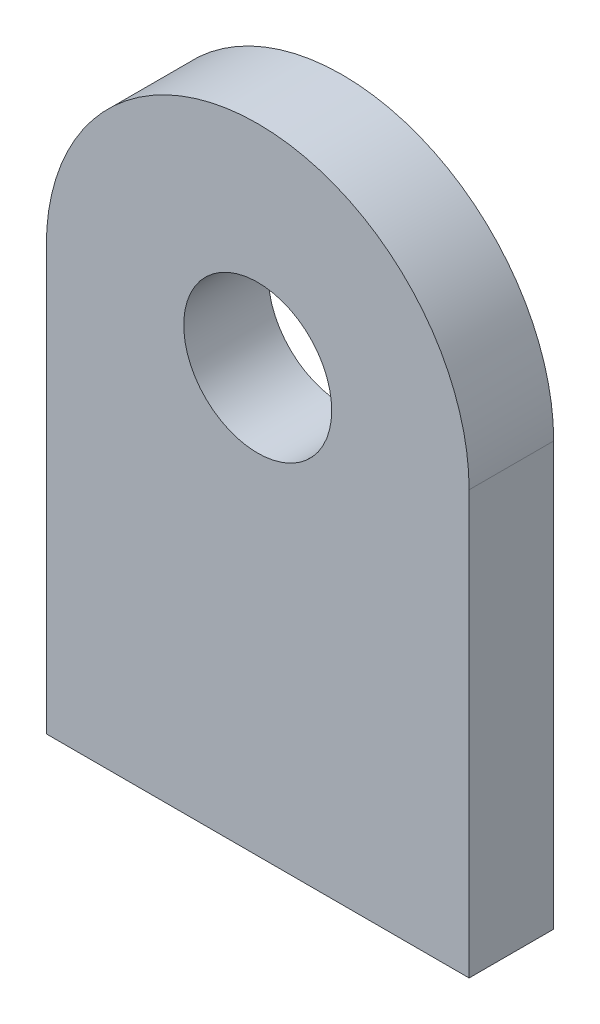
ISO-10303-21;
HEADER;
FILE_DESCRIPTION(('STEP AP214'),'2;1');
FILE_NAME('part.step','',(''),(''),'','','');
FILE_SCHEMA(('AUTOMOTIVE_DESIGN { 1 0 10303 214 1 1 1 1 }'));
ENDSEC;
DATA;
#1=APPLICATION_CONTEXT('core data for automotive mechanical design processes');
#2=APPLICATION_PROTOCOL_DEFINITION('international standard','automotive_design',2000,#1);
#3=PRODUCT_CONTEXT('',#1,'mechanical');
#4=PRODUCT('Part','Part','',(#3));
#5=PRODUCT_RELATED_PRODUCT_CATEGORY('part','',(#4));
#6=PRODUCT_DEFINITION_FORMATION('','',#4);
#7=PRODUCT_DEFINITION_CONTEXT('part definition',#1,'design');
#8=PRODUCT_DEFINITION('design','',#6,#7);
#9=PRODUCT_DEFINITION_SHAPE('','',#8);
#10=(LENGTH_UNIT() NAMED_UNIT(*) SI_UNIT(.MILLI.,.METRE.));
#11=(NAMED_UNIT(*) PLANE_ANGLE_UNIT() SI_UNIT($,.RADIAN.));
#12=(NAMED_UNIT(*) SI_UNIT($,.STERADIAN.) SOLID_ANGLE_UNIT());
#13=UNCERTAINTY_MEASURE_WITH_UNIT(LENGTH_MEASURE(1.E-05),#10,'distance_accuracy_value','');
#14=(GEOMETRIC_REPRESENTATION_CONTEXT(3) GLOBAL_UNCERTAINTY_ASSIGNED_CONTEXT((#13)) GLOBAL_UNIT_ASSIGNED_CONTEXT((#10,
#11,#12)) REPRESENTATION_CONTEXT('',''));
#15=CARTESIAN_POINT('',(0.,0.,0.));
#16=DIRECTION('',(0.,0.,1.));
#17=DIRECTION('',(1.,0.,0.));
#18=AXIS2_PLACEMENT_3D('',#15,#16,#17);
#19=CARTESIAN_POINT('',(0.,100.,20.));
#20=DIRECTION('',(0.,0.,1.));
#21=DIRECTION('',(1.,0.,0.));
#22=AXIS2_PLACEMENT_3D('',#19,#20,#21);
#23=PLANE('',#22);
#24=CARTESIAN_POINT('',(0.,100.,20.));
#25=DIRECTION('',(0.,0.,1.));
#26=DIRECTION('',(1.,0.,0.));
#27=AXIS2_PLACEMENT_3D('',#24,#25,#26);
#28=CIRCLE('',#27,50.);
#29=CARTESIAN_POINT('',(50.,100.,20.));
#30=VERTEX_POINT('',#29);
#31=CARTESIAN_POINT('',(-50.,100.,20.));
#32=VERTEX_POINT('',#31);
#33=EDGE_CURVE('E87',#30,#32,#28,.T.);
#34=ORIENTED_EDGE('',*,*,#33,.T.);
#35=DIRECTION('',(0.,-1.,0.));
#36=VECTOR('',#35,1.);
#37=CARTESIAN_POINT('',(-50.,100.,20.));
#38=LINE('',#37,#36);
#39=CARTESIAN_POINT('',(-50.,0.,20.));
#40=VERTEX_POINT('',#39);
#41=EDGE_CURVE('E82',#32,#40,#38,.T.);
#42=ORIENTED_EDGE('',*,*,#41,.T.);
#43=DIRECTION('',(1.,0.,0.));
#44=VECTOR('',#43,1.);
#45=CARTESIAN_POINT('',(-50.,0.,20.));
#46=LINE('',#45,#44);
#47=CARTESIAN_POINT('',(50.,0.,20.));
#48=VERTEX_POINT('',#47);
#49=EDGE_CURVE('E85',#40,#48,#46,.T.);
#50=ORIENTED_EDGE('',*,*,#49,.T.);
#51=DIRECTION('',(0.,1.,0.));
#52=VECTOR('',#51,1.);
#53=CARTESIAN_POINT('',(50.,0.,20.));
#54=LINE('',#53,#52);
#55=EDGE_CURVE('E52',#48,#30,#54,.T.);
#56=ORIENTED_EDGE('',*,*,#55,.T.);
#57=EDGE_LOOP('',(#34,#42,#50,#56));
#58=FACE_BOUND('',#57,.T.);
#59=CARTESIAN_POINT('',(0.,100.,20.));
#60=DIRECTION('',(0.,0.,1.));
#61=DIRECTION('',(1.,0.,0.));
#62=AXIS2_PLACEMENT_3D('',#59,#60,#61);
#63=CIRCLE('',#62,17.5);
#64=CARTESIAN_POINT('',(17.5,100.,20.));
#65=VERTEX_POINT('',#64);
#66=EDGE_CURVE('E102',#65,#65,#63,.T.);
#67=ORIENTED_EDGE('',*,*,#66,.F.);
#68=EDGE_LOOP('',(#67));
#69=FACE_BOUND('',#68,.T.);
#70=ADVANCED_FACE('F35',(#58,#69),#23,.T.);
#71=CARTESIAN_POINT('',(0.,100.,0.));
#72=DIRECTION('',(0.,0.,1.));
#73=DIRECTION('',(1.,0.,0.));
#74=AXIS2_PLACEMENT_3D('',#71,#72,#73);
#75=PLANE('',#74);
#76=CARTESIAN_POINT('',(0.,100.,0.));
#77=DIRECTION('',(0.,0.,1.));
#78=DIRECTION('',(1.,0.,0.));
#79=AXIS2_PLACEMENT_3D('',#76,#77,#78);
#80=CIRCLE('',#79,50.);
#81=CARTESIAN_POINT('',(50.,100.,0.));
#82=VERTEX_POINT('',#81);
#83=CARTESIAN_POINT('',(-50.,100.,0.));
#84=VERTEX_POINT('',#83);
#85=EDGE_CURVE('E99',#82,#84,#80,.T.);
#86=ORIENTED_EDGE('',*,*,#85,.F.);
#87=DIRECTION('',(0.,1.,0.));
#88=VECTOR('',#87,1.);
#89=CARTESIAN_POINT('',(50.,0.,0.));
#90=LINE('',#89,#88);
#91=CARTESIAN_POINT('',(50.,0.,0.));
#92=VERTEX_POINT('',#91);
#93=EDGE_CURVE('E75',#92,#82,#90,.T.);
#94=ORIENTED_EDGE('',*,*,#93,.F.);
#95=DIRECTION('',(1.,0.,0.));
#96=VECTOR('',#95,1.);
#97=CARTESIAN_POINT('',(-50.,0.,0.));
#98=LINE('',#97,#96);
#99=CARTESIAN_POINT('',(-50.,0.,0.));
#100=VERTEX_POINT('',#99);
#101=EDGE_CURVE('E69',#100,#92,#98,.T.);
#102=ORIENTED_EDGE('',*,*,#101,.F.);
#103=DIRECTION('',(0.,-1.,0.));
#104=VECTOR('',#103,1.);
#105=CARTESIAN_POINT('',(-50.,100.,0.));
#106=LINE('',#105,#104);
#107=EDGE_CURVE('E91',#84,#100,#106,.T.);
#108=ORIENTED_EDGE('',*,*,#107,.F.);
#109=EDGE_LOOP('',(#86,#94,#102,#108));
#110=FACE_BOUND('',#109,.T.);
#111=CARTESIAN_POINT('',(0.,100.,0.));
#112=DIRECTION('',(0.,0.,1.));
#113=DIRECTION('',(1.,0.,0.));
#114=AXIS2_PLACEMENT_3D('',#111,#112,#113);
#115=CIRCLE('',#114,17.5);
#116=CARTESIAN_POINT('',(17.5,100.,0.));
#117=VERTEX_POINT('',#116);
#118=EDGE_CURVE('E114',#117,#117,#115,.T.);
#119=ORIENTED_EDGE('',*,*,#118,.T.);
#120=EDGE_LOOP('',(#119));
#121=FACE_BOUND('',#120,.T.);
#122=ADVANCED_FACE('F110',(#110,#121),#75,.F.);
#123=CARTESIAN_POINT('',(0.,100.,20.));
#124=DIRECTION('',(0.,0.,-1.));
#125=DIRECTION('',(-1.,0.,0.));
#126=AXIS2_PLACEMENT_3D('',#123,#124,#125);
#127=CYLINDRICAL_SURFACE('',#126,50.);
#128=ORIENTED_EDGE('',*,*,#85,.T.);
#129=DIRECTION('',(0.,0.,-1.));
#130=VECTOR('',#129,1.);
#131=CARTESIAN_POINT('',(-50.,100.,20.));
#132=LINE('',#131,#130);
#133=EDGE_CURVE('E11',#32,#84,#132,.T.);
#134=ORIENTED_EDGE('',*,*,#133,.F.);
#135=ORIENTED_EDGE('',*,*,#33,.F.);
#136=DIRECTION('',(0.,0.,-1.));
#137=VECTOR('',#136,1.);
#138=CARTESIAN_POINT('',(50.,100.,20.));
#139=LINE('',#138,#137);
#140=EDGE_CURVE('E95',#30,#82,#139,.T.);
#141=ORIENTED_EDGE('',*,*,#140,.T.);
#142=EDGE_LOOP('',(#128,#134,#135,#141));
#143=FACE_BOUND('',#142,.T.);
#144=ADVANCED_FACE('F37',(#143),#127,.T.);
#145=CARTESIAN_POINT('',(-50.,100.,20.));
#146=DIRECTION('',(1.,0.,0.));
#147=DIRECTION('',(0.,1.,0.));
#148=AXIS2_PLACEMENT_3D('',#145,#146,#147);
#149=PLANE('',#148);
#150=ORIENTED_EDGE('',*,*,#107,.T.);
#151=DIRECTION('',(0.,0.,-1.));
#152=VECTOR('',#151,1.);
#153=CARTESIAN_POINT('',(-50.,0.,20.));
#154=LINE('',#153,#152);
#155=EDGE_CURVE('E44',#40,#100,#154,.T.);
#156=ORIENTED_EDGE('',*,*,#155,.F.);
#157=ORIENTED_EDGE('',*,*,#41,.F.);
#158=ORIENTED_EDGE('',*,*,#133,.T.);
#159=EDGE_LOOP('',(#150,#156,#157,#158));
#160=FACE_BOUND('',#159,.T.);
#161=ADVANCED_FACE('F90',(#160),#149,.F.);
#162=CARTESIAN_POINT('',(-50.,0.,20.));
#163=DIRECTION('',(0.,1.,0.));
#164=DIRECTION('',(-1.,0.,0.));
#165=AXIS2_PLACEMENT_3D('',#162,#163,#164);
#166=PLANE('',#165);
#167=ORIENTED_EDGE('',*,*,#101,.T.);
#168=DIRECTION('',(0.,0.,-1.));
#169=VECTOR('',#168,1.);
#170=CARTESIAN_POINT('',(50.,0.,20.));
#171=LINE('',#170,#169);
#172=EDGE_CURVE('E92',#48,#92,#171,.T.);
#173=ORIENTED_EDGE('',*,*,#172,.F.);
#174=ORIENTED_EDGE('',*,*,#49,.F.);
#175=ORIENTED_EDGE('',*,*,#155,.T.);
#176=EDGE_LOOP('',(#167,#173,#174,#175));
#177=FACE_BOUND('',#176,.T.);
#178=ADVANCED_FACE('F93',(#177),#166,.F.);
#179=CARTESIAN_POINT('',(50.,0.,20.));
#180=DIRECTION('',(-1.,0.,0.));
#181=DIRECTION('',(0.,-1.,0.));
#182=AXIS2_PLACEMENT_3D('',#179,#180,#181);
#183=PLANE('',#182);
#184=ORIENTED_EDGE('',*,*,#93,.T.);
#185=ORIENTED_EDGE('',*,*,#140,.F.);
#186=ORIENTED_EDGE('',*,*,#55,.F.);
#187=ORIENTED_EDGE('',*,*,#172,.T.);
#188=EDGE_LOOP('',(#184,#185,#186,#187));
#189=FACE_BOUND('',#188,.T.);
#190=ADVANCED_FACE('F107',(#189),#183,.F.);
#191=CARTESIAN_POINT('',(0.,100.,20.));
#192=DIRECTION('',(0.,0.,-1.));
#193=DIRECTION('',(-1.,0.,0.));
#194=AXIS2_PLACEMENT_3D('',#191,#192,#193);
#195=CYLINDRICAL_SURFACE('',#194,17.5);
#196=ORIENTED_EDGE('',*,*,#66,.T.);
#197=EDGE_LOOP('',(#196));
#198=FACE_BOUND('',#197,.T.);
#199=ORIENTED_EDGE('',*,*,#118,.F.);
#200=EDGE_LOOP('',(#199));
#201=FACE_BOUND('',#200,.T.);
#202=ADVANCED_FACE('F120',(#198,#201),#195,.F.);
#203=CLOSED_SHELL('',(#70,#122,#144,#161,#178,#190,#202));
#204=MANIFOLD_SOLID_BREP('B2',#203);
#205=ADVANCED_BREP_SHAPE_REPRESENTATION('',(#18,#204),#14);
#206=SHAPE_DEFINITION_REPRESENTATION(#9,#205);
ENDSEC;
END-ISO-10303-21;
